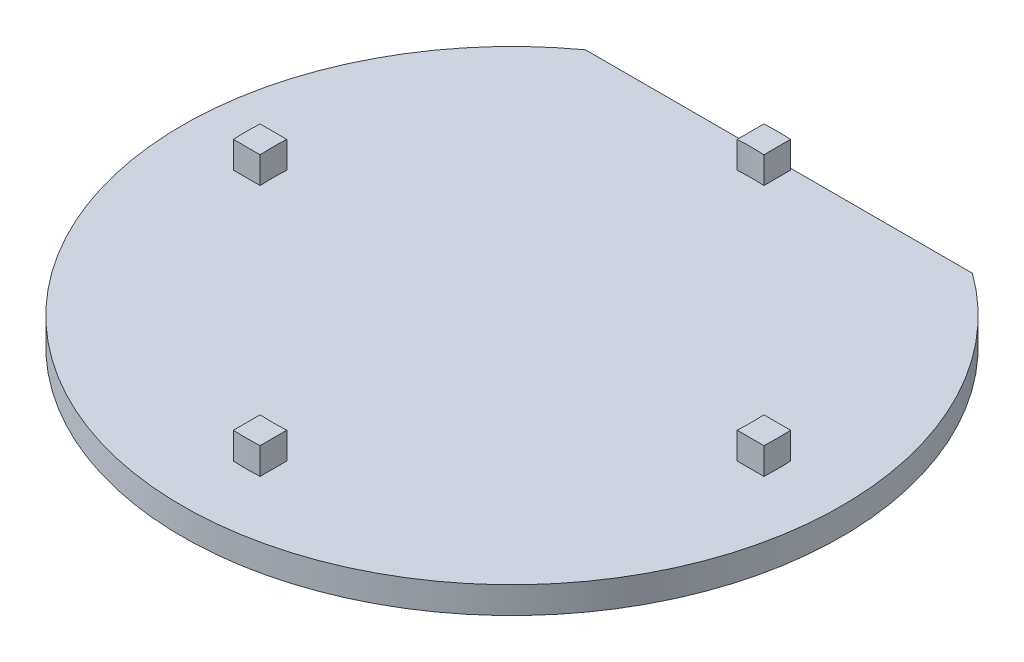
ISO-10303-21;
HEADER;
FILE_DESCRIPTION(('STEP AP214'),'2;1');
FILE_NAME('part.step','',(''),(''),'','','');
FILE_SCHEMA(('AUTOMOTIVE_DESIGN { 1 0 10303 214 1 1 1 1 }'));
ENDSEC;
DATA;
#1=APPLICATION_CONTEXT('core data for automotive mechanical design processes');
#2=APPLICATION_PROTOCOL_DEFINITION('international standard','automotive_design',2000,#1);
#3=PRODUCT_CONTEXT('',#1,'mechanical');
#4=PRODUCT('Part','Part','',(#3));
#5=PRODUCT_RELATED_PRODUCT_CATEGORY('part','',(#4));
#6=PRODUCT_DEFINITION_FORMATION('','',#4);
#7=PRODUCT_DEFINITION_CONTEXT('part definition',#1,'design');
#8=PRODUCT_DEFINITION('design','',#6,#7);
#9=PRODUCT_DEFINITION_SHAPE('','',#8);
#10=(LENGTH_UNIT() NAMED_UNIT(*) SI_UNIT(.MILLI.,.METRE.));
#11=(NAMED_UNIT(*) PLANE_ANGLE_UNIT() SI_UNIT($,.RADIAN.));
#12=(NAMED_UNIT(*) SI_UNIT($,.STERADIAN.) SOLID_ANGLE_UNIT());
#13=UNCERTAINTY_MEASURE_WITH_UNIT(LENGTH_MEASURE(1.E-05),#10,'distance_accuracy_value','');
#14=(GEOMETRIC_REPRESENTATION_CONTEXT(3) GLOBAL_UNCERTAINTY_ASSIGNED_CONTEXT((#13)) GLOBAL_UNIT_ASSIGNED_CONTEXT((#10,
#11,#12)) REPRESENTATION_CONTEXT('',''));
#15=CARTESIAN_POINT('',(0.,0.,0.));
#16=DIRECTION('',(0.,0.,1.));
#17=DIRECTION('',(1.,0.,0.));
#18=AXIS2_PLACEMENT_3D('',#15,#16,#17);
#19=CARTESIAN_POINT('',(0.,2.,0.));
#20=DIRECTION('',(0.,1.,0.));
#21=DIRECTION('',(0.,0.,1.));
#22=AXIS2_PLACEMENT_3D('',#19,#20,#21);
#23=PLANE('',#22);
#24=DIRECTION('',(1.,0.,0.));
#25=VECTOR('',#24,1.);
#26=CARTESIAN_POINT('',(17.8720452103278,2.,1.00000000000012));
#27=LINE('',#26,#25);
#28=CARTESIAN_POINT('',(17.8720452103278,2.,1.00000000000012));
#29=VERTEX_POINT('',#28);
#30=CARTESIAN_POINT('',(19.8748584900622,2.,1.00000000000014));
#31=VERTEX_POINT('',#30);
#32=EDGE_CURVE('E191',#29,#31,#27,.T.);
#33=ORIENTED_EDGE('',*,*,#32,.F.);
#34=CARTESIAN_POINT('',(0.,2.,0.));
#35=DIRECTION('',(0.,-1.,0.));
#36=DIRECTION('',(0.,0.,1.));
#37=AXIS2_PLACEMENT_3D('',#34,#35,#36);
#38=CIRCLE('',#37,17.9);
#39=CARTESIAN_POINT('',(17.8720452103278,2.,-0.999999999999875));
#40=VERTEX_POINT('',#39);
#41=EDGE_CURVE('E188',#40,#29,#38,.T.);
#42=ORIENTED_EDGE('',*,*,#41,.F.);
#43=DIRECTION('',(-1.,0.,0.));
#44=VECTOR('',#43,1.);
#45=CARTESIAN_POINT('',(17.8720452103278,2.,-0.999999999999875));
#46=LINE('',#45,#44);
#47=CARTESIAN_POINT('',(19.8748584900623,2.,-0.99999999999986));
#48=VERTEX_POINT('',#47);
#49=EDGE_CURVE('E200',#48,#40,#46,.T.);
#50=ORIENTED_EDGE('',*,*,#49,.F.);
#51=CARTESIAN_POINT('',(0.,2.,0.));
#52=DIRECTION('',(0.,1.,0.));
#53=DIRECTION('',(0.,0.,1.));
#54=AXIS2_PLACEMENT_3D('',#51,#52,#53);
#55=CIRCLE('',#54,19.9);
#56=EDGE_CURVE('E208',#31,#48,#55,.T.);
#57=ORIENTED_EDGE('',*,*,#56,.F.);
#58=EDGE_LOOP('',(#33,#42,#50,#57));
#59=FACE_BOUND('',#58,.T.);
#60=DIRECTION('',(-1.,0.,0.));
#61=VECTOR('',#60,1.);
#62=CARTESIAN_POINT('',(-17.8720452103278,2.,-1.));
#63=LINE('',#62,#61);
#64=CARTESIAN_POINT('',(-17.8720452103278,2.,-1.));
#65=VERTEX_POINT('',#64);
#66=CARTESIAN_POINT('',(-19.8748584900623,2.,-0.999999999999999));
#67=VERTEX_POINT('',#66);
#68=EDGE_CURVE('E262',#65,#67,#63,.T.);
#69=ORIENTED_EDGE('',*,*,#68,.F.);
#70=CARTESIAN_POINT('',(0.,2.,0.));
#71=DIRECTION('',(0.,-1.,0.));
#72=DIRECTION('',(0.,0.,1.));
#73=AXIS2_PLACEMENT_3D('',#70,#71,#72);
#74=CIRCLE('',#73,17.9);
#75=CARTESIAN_POINT('',(-17.8720452103278,2.,1.));
#76=VERTEX_POINT('',#75);
#77=EDGE_CURVE('E248',#76,#65,#74,.T.);
#78=ORIENTED_EDGE('',*,*,#77,.F.);
#79=DIRECTION('',(1.,0.,0.));
#80=VECTOR('',#79,1.);
#81=CARTESIAN_POINT('',(-17.8720452103278,2.,1.));
#82=LINE('',#81,#80);
#83=CARTESIAN_POINT('',(-19.8748584900623,2.,0.999999999999999));
#84=VERTEX_POINT('',#83);
#85=EDGE_CURVE('E253',#84,#76,#82,.T.);
#86=ORIENTED_EDGE('',*,*,#85,.F.);
#87=CARTESIAN_POINT('',(0.,2.,0.));
#88=DIRECTION('',(0.,1.,0.));
#89=DIRECTION('',(0.,0.,1.));
#90=AXIS2_PLACEMENT_3D('',#87,#88,#89);
#91=CIRCLE('',#90,19.9);
#92=EDGE_CURVE('E264',#67,#84,#91,.T.);
#93=ORIENTED_EDGE('',*,*,#92,.F.);
#94=EDGE_LOOP('',(#69,#78,#86,#93));
#95=FACE_BOUND('',#94,.T.);
#96=CARTESIAN_POINT('',(0.,2.,0.));
#97=DIRECTION('',(0.,1.,0.));
#98=DIRECTION('',(0.,0.,1.));
#99=AXIS2_PLACEMENT_3D('',#96,#97,#98);
#100=CIRCLE('',#99,24.7);
#101=CARTESIAN_POINT('',(-14.4944817085676,2.,-20.));
#102=VERTEX_POINT('',#101);
#103=CARTESIAN_POINT('',(14.4944817085676,2.,-20.));
#104=VERTEX_POINT('',#103);
#105=EDGE_CURVE('E278',#102,#104,#100,.T.);
#106=ORIENTED_EDGE('',*,*,#105,.T.);
#107=DIRECTION('',(-1.,0.,0.));
#108=VECTOR('',#107,1.);
#109=CARTESIAN_POINT('',(14.4944817085676,2.,-20.));
#110=LINE('',#109,#108);
#111=EDGE_CURVE('E281',#104,#102,#110,.T.);
#112=ORIENTED_EDGE('',*,*,#111,.T.);
#113=EDGE_LOOP('',(#106,#112));
#114=FACE_BOUND('',#113,.T.);
#115=DIRECTION('',(0.,0.,-1.));
#116=VECTOR('',#115,1.);
#117=CARTESIAN_POINT('',(1.00000000000006,2.,-17.8720452103278));
#118=LINE('',#117,#116);
#119=CARTESIAN_POINT('',(1.00000000000006,2.,-17.8720452103278));
#120=VERTEX_POINT('',#119);
#121=CARTESIAN_POINT('',(1.00000000000007,2.,-19.8748584900623));
#122=VERTEX_POINT('',#121);
#123=EDGE_CURVE('E233',#120,#122,#118,.T.);
#124=ORIENTED_EDGE('',*,*,#123,.F.);
#125=CARTESIAN_POINT('',(0.,2.,0.));
#126=DIRECTION('',(0.,-1.,0.));
#127=DIRECTION('',(0.,0.,1.));
#128=AXIS2_PLACEMENT_3D('',#125,#126,#127);
#129=CIRCLE('',#128,17.9);
#130=CARTESIAN_POINT('',(-0.999999999999937,2.,-17.8720452103278));
#131=VERTEX_POINT('',#130);
#132=EDGE_CURVE('E219',#131,#120,#129,.T.);
#133=ORIENTED_EDGE('',*,*,#132,.F.);
#134=DIRECTION('',(0.,0.,1.));
#135=VECTOR('',#134,1.);
#136=CARTESIAN_POINT('',(-0.999999999999937,2.,-17.8720452103278));
#137=LINE('',#136,#135);
#138=CARTESIAN_POINT('',(-0.99999999999993,2.,-19.8748584900623));
#139=VERTEX_POINT('',#138);
#140=EDGE_CURVE('E224',#139,#131,#137,.T.);
#141=ORIENTED_EDGE('',*,*,#140,.F.);
#142=CARTESIAN_POINT('',(0.,2.,0.));
#143=DIRECTION('',(0.,1.,0.));
#144=DIRECTION('',(0.,0.,1.));
#145=AXIS2_PLACEMENT_3D('',#142,#143,#144);
#146=CIRCLE('',#145,19.9);
#147=EDGE_CURVE('E235',#122,#139,#146,.T.);
#148=ORIENTED_EDGE('',*,*,#147,.F.);
#149=EDGE_LOOP('',(#124,#133,#141,#148));
#150=FACE_BOUND('',#149,.T.);
#151=DIRECTION('',(0.,0.,1.));
#152=VECTOR('',#151,1.);
#153=CARTESIAN_POINT('',(-1.00000000000019,2.,17.8720452103278));
#154=LINE('',#153,#152);
#155=CARTESIAN_POINT('',(-1.00000000000019,2.,17.8720452103278));
#156=VERTEX_POINT('',#155);
#157=CARTESIAN_POINT('',(-1.00000000000021,2.,19.8748584900622));
#158=VERTEX_POINT('',#157);
#159=EDGE_CURVE('E306',#156,#158,#154,.T.);
#160=ORIENTED_EDGE('',*,*,#159,.F.);
#161=CARTESIAN_POINT('',(0.,2.,0.));
#162=DIRECTION('',(0.,-1.,0.));
#163=DIRECTION('',(0.,0.,1.));
#164=AXIS2_PLACEMENT_3D('',#161,#162,#163);
#165=CIRCLE('',#164,17.9);
#166=CARTESIAN_POINT('',(0.999999999999812,2.,17.8720452103278));
#167=VERTEX_POINT('',#166);
#168=EDGE_CURVE('E186',#167,#156,#165,.T.);
#169=ORIENTED_EDGE('',*,*,#168,.F.);
#170=DIRECTION('',(0.,0.,-1.));
#171=VECTOR('',#170,1.);
#172=CARTESIAN_POINT('',(0.999999999999812,2.,17.8720452103278));
#173=LINE('',#172,#171);
#174=CARTESIAN_POINT('',(0.999999999999791,2.,19.8748584900623));
#175=VERTEX_POINT('',#174);
#176=EDGE_CURVE('E182',#175,#167,#173,.T.);
#177=ORIENTED_EDGE('',*,*,#176,.F.);
#178=CARTESIAN_POINT('',(0.,2.,0.));
#179=DIRECTION('',(0.,1.,0.));
#180=DIRECTION('',(0.,0.,1.));
#181=AXIS2_PLACEMENT_3D('',#178,#179,#180);
#182=CIRCLE('',#181,19.9);
#183=EDGE_CURVE('E308',#158,#175,#182,.T.);
#184=ORIENTED_EDGE('',*,*,#183,.F.);
#185=EDGE_LOOP('',(#160,#169,#177,#184));
#186=FACE_BOUND('',#185,.T.);
#187=ADVANCED_FACE('F37',(#59,#95,#114,#150,#186),#23,.T.);
#188=CARTESIAN_POINT('',(0.,2.,0.));
#189=DIRECTION('',(0.,-1.,0.));
#190=DIRECTION('',(0.,0.,-1.));
#191=AXIS2_PLACEMENT_3D('',#188,#189,#190);
#192=CYLINDRICAL_SURFACE('',#191,24.7);
#193=CARTESIAN_POINT('',(0.,0.,0.));
#194=DIRECTION('',(0.,1.,0.));
#195=DIRECTION('',(0.,0.,1.));
#196=AXIS2_PLACEMENT_3D('',#193,#194,#195);
#197=CIRCLE('',#196,24.7);
#198=CARTESIAN_POINT('',(-14.4944817085676,0.,-20.));
#199=VERTEX_POINT('',#198);
#200=CARTESIAN_POINT('',(14.4944817085676,0.,-20.));
#201=VERTEX_POINT('',#200);
#202=EDGE_CURVE('E277',#199,#201,#197,.T.);
#203=ORIENTED_EDGE('',*,*,#202,.T.);
#204=DIRECTION('',(0.,-1.,0.));
#205=VECTOR('',#204,1.);
#206=CARTESIAN_POINT('',(14.4944817085676,2.,-20.));
#207=LINE('',#206,#205);
#208=EDGE_CURVE('E11',#104,#201,#207,.T.);
#209=ORIENTED_EDGE('',*,*,#208,.F.);
#210=ORIENTED_EDGE('',*,*,#105,.F.);
#211=DIRECTION('',(0.,-1.,0.));
#212=VECTOR('',#211,1.);
#213=CARTESIAN_POINT('',(-14.4944817085676,2.,-20.));
#214=LINE('',#213,#212);
#215=EDGE_CURVE('E45',#102,#199,#214,.T.);
#216=ORIENTED_EDGE('',*,*,#215,.T.);
#217=EDGE_LOOP('',(#203,#209,#210,#216));
#218=FACE_BOUND('',#217,.T.);
#219=ADVANCED_FACE('F39',(#218),#192,.T.);
#220=CARTESIAN_POINT('',(14.4944817085676,2.,-20.));
#221=DIRECTION('',(0.,0.,1.));
#222=DIRECTION('',(1.,0.,0.));
#223=AXIS2_PLACEMENT_3D('',#220,#221,#222);
#224=PLANE('',#223);
#225=DIRECTION('',(-1.,0.,0.));
#226=VECTOR('',#225,1.);
#227=CARTESIAN_POINT('',(14.4944817085676,0.,-20.));
#228=LINE('',#227,#226);
#229=EDGE_CURVE('E282',#201,#199,#228,.T.);
#230=ORIENTED_EDGE('',*,*,#229,.T.);
#231=ORIENTED_EDGE('',*,*,#215,.F.);
#232=ORIENTED_EDGE('',*,*,#111,.F.);
#233=ORIENTED_EDGE('',*,*,#208,.T.);
#234=EDGE_LOOP('',(#230,#231,#232,#233));
#235=FACE_BOUND('',#234,.T.);
#236=ADVANCED_FACE('F295',(#235),#224,.F.);
#237=CARTESIAN_POINT('',(0.,0.,0.));
#238=DIRECTION('',(0.,1.,0.));
#239=DIRECTION('',(0.,0.,1.));
#240=AXIS2_PLACEMENT_3D('',#237,#238,#239);
#241=PLANE('',#240);
#242=ORIENTED_EDGE('',*,*,#202,.F.);
#243=ORIENTED_EDGE('',*,*,#229,.F.);
#244=EDGE_LOOP('',(#242,#243));
#245=FACE_BOUND('',#244,.T.);
#246=ADVANCED_FACE('F294',(#245),#241,.F.);
#247=CARTESIAN_POINT('',(0.,4.,0.));
#248=DIRECTION('',(0.,-1.,0.));
#249=DIRECTION('',(0.,0.,-1.));
#250=AXIS2_PLACEMENT_3D('',#247,#248,#249);
#251=CYLINDRICAL_SURFACE('',#250,17.9);
#252=ORIENTED_EDGE('',*,*,#77,.T.);
#253=DIRECTION('',(0.,-1.,0.));
#254=VECTOR('',#253,1.);
#255=CARTESIAN_POINT('',(-17.8720452103278,4.,-1.));
#256=LINE('',#255,#254);
#257=CARTESIAN_POINT('',(-17.8720452103278,4.,-1.));
#258=VERTEX_POINT('',#257);
#259=EDGE_CURVE('E275',#258,#65,#256,.T.);
#260=ORIENTED_EDGE('',*,*,#259,.F.);
#261=CARTESIAN_POINT('',(0.,4.,0.));
#262=DIRECTION('',(0.,-1.,0.));
#263=DIRECTION('',(0.,0.,1.));
#264=AXIS2_PLACEMENT_3D('',#261,#262,#263);
#265=CIRCLE('',#264,17.9);
#266=CARTESIAN_POINT('',(-17.8720452103278,4.,1.));
#267=VERTEX_POINT('',#266);
#268=EDGE_CURVE('E249',#267,#258,#265,.T.);
#269=ORIENTED_EDGE('',*,*,#268,.F.);
#270=DIRECTION('',(0.,-1.,0.));
#271=VECTOR('',#270,1.);
#272=CARTESIAN_POINT('',(-17.8720452103278,4.,1.));
#273=LINE('',#272,#271);
#274=EDGE_CURVE('E259',#267,#76,#273,.T.);
#275=ORIENTED_EDGE('',*,*,#274,.T.);
#276=EDGE_LOOP('',(#252,#260,#269,#275));
#277=FACE_BOUND('',#276,.T.);
#278=ADVANCED_FACE('F387',(#277),#251,.F.);
#279=CARTESIAN_POINT('',(-17.8720452103278,4.,-1.));
#280=DIRECTION('',(0.,0.,1.));
#281=DIRECTION('',(1.,0.,0.));
#282=AXIS2_PLACEMENT_3D('',#279,#280,#281);
#283=PLANE('',#282);
#284=ORIENTED_EDGE('',*,*,#68,.T.);
#285=DIRECTION('',(0.,-1.,0.));
#286=VECTOR('',#285,1.);
#287=CARTESIAN_POINT('',(-19.8748584900623,4.,-0.999999999999999));
#288=LINE('',#287,#286);
#289=CARTESIAN_POINT('',(-19.8748584900623,4.,-0.999999999999999));
#290=VERTEX_POINT('',#289);
#291=EDGE_CURVE('E272',#290,#67,#288,.T.);
#292=ORIENTED_EDGE('',*,*,#291,.F.);
#293=DIRECTION('',(-1.,0.,0.));
#294=VECTOR('',#293,1.);
#295=CARTESIAN_POINT('',(-17.8720452103278,4.,-1.));
#296=LINE('',#295,#294);
#297=EDGE_CURVE('E252',#258,#290,#296,.T.);
#298=ORIENTED_EDGE('',*,*,#297,.F.);
#299=ORIENTED_EDGE('',*,*,#259,.T.);
#300=EDGE_LOOP('',(#284,#292,#298,#299));
#301=FACE_BOUND('',#300,.T.);
#302=ADVANCED_FACE('F383',(#301),#283,.F.);
#303=CARTESIAN_POINT('',(0.,4.,0.));
#304=DIRECTION('',(0.,-1.,0.));
#305=DIRECTION('',(0.,0.,-1.));
#306=AXIS2_PLACEMENT_3D('',#303,#304,#305);
#307=CYLINDRICAL_SURFACE('',#306,19.9);
#308=ORIENTED_EDGE('',*,*,#92,.T.);
#309=DIRECTION('',(0.,-1.,0.));
#310=VECTOR('',#309,1.);
#311=CARTESIAN_POINT('',(-19.8748584900623,4.,0.999999999999997));
#312=LINE('',#311,#310);
#313=CARTESIAN_POINT('',(-19.8748584900623,4.,0.999999999999997));
#314=VERTEX_POINT('',#313);
#315=EDGE_CURVE('E270',#314,#84,#312,.T.);
#316=ORIENTED_EDGE('',*,*,#315,.F.);
#317=CARTESIAN_POINT('',(0.,4.,0.));
#318=DIRECTION('',(0.,1.,0.));
#319=DIRECTION('',(0.,0.,1.));
#320=AXIS2_PLACEMENT_3D('',#317,#318,#319);
#321=CIRCLE('',#320,19.9);
#322=EDGE_CURVE('E255',#290,#314,#321,.T.);
#323=ORIENTED_EDGE('',*,*,#322,.F.);
#324=ORIENTED_EDGE('',*,*,#291,.T.);
#325=EDGE_LOOP('',(#308,#316,#323,#324));
#326=FACE_BOUND('',#325,.T.);
#327=ADVANCED_FACE('F379',(#326),#307,.T.);
#328=CARTESIAN_POINT('',(-17.8720452103278,4.,1.));
#329=DIRECTION('',(0.,0.,-1.));
#330=DIRECTION('',(-1.,0.,0.));
#331=AXIS2_PLACEMENT_3D('',#328,#329,#330);
#332=PLANE('',#331);
#333=ORIENTED_EDGE('',*,*,#85,.T.);
#334=ORIENTED_EDGE('',*,*,#274,.F.);
#335=DIRECTION('',(1.,0.,0.));
#336=VECTOR('',#335,1.);
#337=CARTESIAN_POINT('',(-17.8720452103278,4.,1.));
#338=LINE('',#337,#336);
#339=EDGE_CURVE('E257',#314,#267,#338,.T.);
#340=ORIENTED_EDGE('',*,*,#339,.F.);
#341=ORIENTED_EDGE('',*,*,#315,.T.);
#342=EDGE_LOOP('',(#333,#334,#340,#341));
#343=FACE_BOUND('',#342,.T.);
#344=ADVANCED_FACE('F375',(#343),#332,.F.);
#345=CARTESIAN_POINT('',(0.,4.,0.));
#346=DIRECTION('',(0.,1.,0.));
#347=DIRECTION('',(0.,0.,1.));
#348=AXIS2_PLACEMENT_3D('',#345,#346,#347);
#349=PLANE('',#348);
#350=ORIENTED_EDGE('',*,*,#268,.T.);
#351=ORIENTED_EDGE('',*,*,#297,.T.);
#352=ORIENTED_EDGE('',*,*,#322,.T.);
#353=ORIENTED_EDGE('',*,*,#339,.T.);
#354=EDGE_LOOP('',(#350,#351,#352,#353));
#355=FACE_BOUND('',#354,.T.);
#356=ADVANCED_FACE('F371',(#355),#349,.T.);
#357=CARTESIAN_POINT('',(0.,4.,0.));
#358=DIRECTION('',(0.,-1.,0.));
#359=DIRECTION('',(0.,0.,-1.));
#360=AXIS2_PLACEMENT_3D('',#357,#358,#359);
#361=CYLINDRICAL_SURFACE('',#360,17.9);
#362=ORIENTED_EDGE('',*,*,#132,.T.);
#363=DIRECTION('',(0.,-1.,0.));
#364=VECTOR('',#363,1.);
#365=CARTESIAN_POINT('',(1.00000000000006,4.,-17.8720452103278));
#366=LINE('',#365,#364);
#367=CARTESIAN_POINT('',(1.00000000000006,4.,-17.8720452103278));
#368=VERTEX_POINT('',#367);
#369=EDGE_CURVE('E246',#368,#120,#366,.T.);
#370=ORIENTED_EDGE('',*,*,#369,.F.);
#371=CARTESIAN_POINT('',(0.,4.,0.));
#372=DIRECTION('',(0.,-1.,0.));
#373=DIRECTION('',(0.,0.,1.));
#374=AXIS2_PLACEMENT_3D('',#371,#372,#373);
#375=CIRCLE('',#374,17.9);
#376=CARTESIAN_POINT('',(-0.999999999999937,4.,-17.8720452103278));
#377=VERTEX_POINT('',#376);
#378=EDGE_CURVE('E220',#377,#368,#375,.T.);
#379=ORIENTED_EDGE('',*,*,#378,.F.);
#380=DIRECTION('',(0.,-1.,0.));
#381=VECTOR('',#380,1.);
#382=CARTESIAN_POINT('',(-0.999999999999937,4.,-17.8720452103278));
#383=LINE('',#382,#381);
#384=EDGE_CURVE('E230',#377,#131,#383,.T.);
#385=ORIENTED_EDGE('',*,*,#384,.T.);
#386=EDGE_LOOP('',(#362,#370,#379,#385));
#387=FACE_BOUND('',#386,.T.);
#388=ADVANCED_FACE('F367',(#387),#361,.F.);
#389=CARTESIAN_POINT('',(1.00000000000006,4.,-17.8720452103278));
#390=DIRECTION('',(-1.,0.,0.));
#391=DIRECTION('',(0.,0.,1.));
#392=AXIS2_PLACEMENT_3D('',#389,#390,#391);
#393=PLANE('',#392);
#394=ORIENTED_EDGE('',*,*,#123,.T.);
#395=DIRECTION('',(0.,-1.,0.));
#396=VECTOR('',#395,1.);
#397=CARTESIAN_POINT('',(1.00000000000007,4.,-19.8748584900623));
#398=LINE('',#397,#396);
#399=CARTESIAN_POINT('',(1.00000000000007,4.,-19.8748584900623));
#400=VERTEX_POINT('',#399);
#401=EDGE_CURVE('E243',#400,#122,#398,.T.);
#402=ORIENTED_EDGE('',*,*,#401,.F.);
#403=DIRECTION('',(0.,0.,-1.));
#404=VECTOR('',#403,1.);
#405=CARTESIAN_POINT('',(1.00000000000006,4.,-17.8720452103278));
#406=LINE('',#405,#404);
#407=EDGE_CURVE('E223',#368,#400,#406,.T.);
#408=ORIENTED_EDGE('',*,*,#407,.F.);
#409=ORIENTED_EDGE('',*,*,#369,.T.);
#410=EDGE_LOOP('',(#394,#402,#408,#409));
#411=FACE_BOUND('',#410,.T.);
#412=ADVANCED_FACE('F363',(#411),#393,.F.);
#413=CARTESIAN_POINT('',(0.,4.,0.));
#414=DIRECTION('',(0.,-1.,0.));
#415=DIRECTION('',(0.,0.,-1.));
#416=AXIS2_PLACEMENT_3D('',#413,#414,#415);
#417=CYLINDRICAL_SURFACE('',#416,19.9);
#418=ORIENTED_EDGE('',*,*,#147,.T.);
#419=DIRECTION('',(0.,-1.,0.));
#420=VECTOR('',#419,1.);
#421=CARTESIAN_POINT('',(-0.999999999999928,4.,-19.8748584900623));
#422=LINE('',#421,#420);
#423=CARTESIAN_POINT('',(-0.999999999999928,4.,-19.8748584900623));
#424=VERTEX_POINT('',#423);
#425=EDGE_CURVE('E241',#424,#139,#422,.T.);
#426=ORIENTED_EDGE('',*,*,#425,.F.);
#427=CARTESIAN_POINT('',(0.,4.,0.));
#428=DIRECTION('',(0.,1.,0.));
#429=DIRECTION('',(0.,0.,1.));
#430=AXIS2_PLACEMENT_3D('',#427,#428,#429);
#431=CIRCLE('',#430,19.9);
#432=EDGE_CURVE('E226',#400,#424,#431,.T.);
#433=ORIENTED_EDGE('',*,*,#432,.F.);
#434=ORIENTED_EDGE('',*,*,#401,.T.);
#435=EDGE_LOOP('',(#418,#426,#433,#434));
#436=FACE_BOUND('',#435,.T.);
#437=ADVANCED_FACE('F359',(#436),#417,.T.);
#438=CARTESIAN_POINT('',(-0.999999999999937,4.,-17.8720452103278));
#439=DIRECTION('',(1.,0.,0.));
#440=DIRECTION('',(0.,0.,-1.));
#441=AXIS2_PLACEMENT_3D('',#438,#439,#440);
#442=PLANE('',#441);
#443=ORIENTED_EDGE('',*,*,#140,.T.);
#444=ORIENTED_EDGE('',*,*,#384,.F.);
#445=DIRECTION('',(0.,0.,1.));
#446=VECTOR('',#445,1.);
#447=CARTESIAN_POINT('',(-0.999999999999937,4.,-17.8720452103278));
#448=LINE('',#447,#446);
#449=EDGE_CURVE('E228',#424,#377,#448,.T.);
#450=ORIENTED_EDGE('',*,*,#449,.F.);
#451=ORIENTED_EDGE('',*,*,#425,.T.);
#452=EDGE_LOOP('',(#443,#444,#450,#451));
#453=FACE_BOUND('',#452,.T.);
#454=ADVANCED_FACE('F355',(#453),#442,.F.);
#455=CARTESIAN_POINT('',(0.,4.,0.));
#456=DIRECTION('',(0.,1.,0.));
#457=DIRECTION('',(0.,0.,1.));
#458=AXIS2_PLACEMENT_3D('',#455,#456,#457);
#459=PLANE('',#458);
#460=ORIENTED_EDGE('',*,*,#378,.T.);
#461=ORIENTED_EDGE('',*,*,#407,.T.);
#462=ORIENTED_EDGE('',*,*,#432,.T.);
#463=ORIENTED_EDGE('',*,*,#449,.T.);
#464=EDGE_LOOP('',(#460,#461,#462,#463));
#465=FACE_BOUND('',#464,.T.);
#466=ADVANCED_FACE('F351',(#465),#459,.T.);
#467=CARTESIAN_POINT('',(0.,4.,0.));
#468=DIRECTION('',(0.,-1.,0.));
#469=DIRECTION('',(0.,0.,-1.));
#470=AXIS2_PLACEMENT_3D('',#467,#468,#469);
#471=CYLINDRICAL_SURFACE('',#470,17.9);
#472=ORIENTED_EDGE('',*,*,#41,.T.);
#473=DIRECTION('',(0.,-1.,0.));
#474=VECTOR('',#473,1.);
#475=CARTESIAN_POINT('',(17.8720452103278,4.,1.00000000000012));
#476=LINE('',#475,#474);
#477=CARTESIAN_POINT('',(17.8720452103278,4.,1.00000000000012));
#478=VERTEX_POINT('',#477);
#479=EDGE_CURVE('E217',#478,#29,#476,.T.);
#480=ORIENTED_EDGE('',*,*,#479,.F.);
#481=CARTESIAN_POINT('',(0.,4.,0.));
#482=DIRECTION('',(0.,-1.,0.));
#483=DIRECTION('',(0.,0.,1.));
#484=AXIS2_PLACEMENT_3D('',#481,#482,#483);
#485=CIRCLE('',#484,17.9);
#486=CARTESIAN_POINT('',(17.8720452103278,4.,-0.999999999999875));
#487=VERTEX_POINT('',#486);
#488=EDGE_CURVE('E196',#487,#478,#485,.T.);
#489=ORIENTED_EDGE('',*,*,#488,.F.);
#490=DIRECTION('',(0.,-1.,0.));
#491=VECTOR('',#490,1.);
#492=CARTESIAN_POINT('',(17.8720452103278,4.,-0.999999999999875));
#493=LINE('',#492,#491);
#494=EDGE_CURVE('E205',#487,#40,#493,.T.);
#495=ORIENTED_EDGE('',*,*,#494,.T.);
#496=EDGE_LOOP('',(#472,#480,#489,#495));
#497=FACE_BOUND('',#496,.T.);
#498=ADVANCED_FACE('F347',(#497),#471,.F.);
#499=CARTESIAN_POINT('',(17.8720452103278,4.,1.00000000000012));
#500=DIRECTION('',(0.,0.,-1.));
#501=DIRECTION('',(-1.,0.,0.));
#502=AXIS2_PLACEMENT_3D('',#499,#500,#501);
#503=PLANE('',#502);
#504=ORIENTED_EDGE('',*,*,#32,.T.);
#505=DIRECTION('',(0.,-1.,0.));
#506=VECTOR('',#505,1.);
#507=CARTESIAN_POINT('',(19.8748584900622,4.,1.00000000000014));
#508=LINE('',#507,#506);
#509=CARTESIAN_POINT('',(19.8748584900622,4.,1.00000000000014));
#510=VERTEX_POINT('',#509);
#511=EDGE_CURVE('E214',#510,#31,#508,.T.);
#512=ORIENTED_EDGE('',*,*,#511,.F.);
#513=DIRECTION('',(1.,0.,0.));
#514=VECTOR('',#513,1.);
#515=CARTESIAN_POINT('',(17.8720452103278,4.,1.00000000000012));
#516=LINE('',#515,#514);
#517=EDGE_CURVE('E199',#478,#510,#516,.T.);
#518=ORIENTED_EDGE('',*,*,#517,.F.);
#519=ORIENTED_EDGE('',*,*,#479,.T.);
#520=EDGE_LOOP('',(#504,#512,#518,#519));
#521=FACE_BOUND('',#520,.T.);
#522=ADVANCED_FACE('F343',(#521),#503,.F.);
#523=CARTESIAN_POINT('',(0.,4.,0.));
#524=DIRECTION('',(0.,-1.,0.));
#525=DIRECTION('',(0.,0.,-1.));
#526=AXIS2_PLACEMENT_3D('',#523,#524,#525);
#527=CYLINDRICAL_SURFACE('',#526,19.9);
#528=ORIENTED_EDGE('',*,*,#56,.T.);
#529=DIRECTION('',(0.,-1.,0.));
#530=VECTOR('',#529,1.);
#531=CARTESIAN_POINT('',(19.8748584900623,4.,-0.999999999999858));
#532=LINE('',#531,#530);
#533=CARTESIAN_POINT('',(19.8748584900623,4.,-0.999999999999858));
#534=VERTEX_POINT('',#533);
#535=EDGE_CURVE('E60',#534,#48,#532,.T.);
#536=ORIENTED_EDGE('',*,*,#535,.F.);
#537=CARTESIAN_POINT('',(0.,4.,0.));
#538=DIRECTION('',(0.,1.,0.));
#539=DIRECTION('',(0.,0.,1.));
#540=AXIS2_PLACEMENT_3D('',#537,#538,#539);
#541=CIRCLE('',#540,19.9);
#542=EDGE_CURVE('E202',#510,#534,#541,.T.);
#543=ORIENTED_EDGE('',*,*,#542,.F.);
#544=ORIENTED_EDGE('',*,*,#511,.T.);
#545=EDGE_LOOP('',(#528,#536,#543,#544));
#546=FACE_BOUND('',#545,.T.);
#547=ADVANCED_FACE('F340',(#546),#527,.T.);
#548=CARTESIAN_POINT('',(17.8720452103278,4.,-0.999999999999875));
#549=DIRECTION('',(0.,0.,1.));
#550=DIRECTION('',(1.,0.,0.));
#551=AXIS2_PLACEMENT_3D('',#548,#549,#550);
#552=PLANE('',#551);
#553=ORIENTED_EDGE('',*,*,#49,.T.);
#554=ORIENTED_EDGE('',*,*,#494,.F.);
#555=DIRECTION('',(-1.,0.,0.));
#556=VECTOR('',#555,1.);
#557=CARTESIAN_POINT('',(17.8720452103278,4.,-0.999999999999875));
#558=LINE('',#557,#556);
#559=EDGE_CURVE('E204',#534,#487,#558,.T.);
#560=ORIENTED_EDGE('',*,*,#559,.F.);
#561=ORIENTED_EDGE('',*,*,#535,.T.);
#562=EDGE_LOOP('',(#553,#554,#560,#561));
#563=FACE_BOUND('',#562,.T.);
#564=ADVANCED_FACE('F336',(#563),#552,.F.);
#565=CARTESIAN_POINT('',(0.,4.,0.));
#566=DIRECTION('',(0.,1.,0.));
#567=DIRECTION('',(0.,0.,1.));
#568=AXIS2_PLACEMENT_3D('',#565,#566,#567);
#569=PLANE('',#568);
#570=ORIENTED_EDGE('',*,*,#488,.T.);
#571=ORIENTED_EDGE('',*,*,#517,.T.);
#572=ORIENTED_EDGE('',*,*,#542,.T.);
#573=ORIENTED_EDGE('',*,*,#559,.T.);
#574=EDGE_LOOP('',(#570,#571,#572,#573));
#575=FACE_BOUND('',#574,.T.);
#576=ADVANCED_FACE('F333',(#575),#569,.T.);
#577=CARTESIAN_POINT('',(0.,4.,0.));
#578=DIRECTION('',(0.,-1.,0.));
#579=DIRECTION('',(0.,0.,-1.));
#580=AXIS2_PLACEMENT_3D('',#577,#578,#579);
#581=CYLINDRICAL_SURFACE('',#580,17.9);
#582=ORIENTED_EDGE('',*,*,#168,.T.);
#583=DIRECTION('',(0.,-1.,0.));
#584=VECTOR('',#583,1.);
#585=CARTESIAN_POINT('',(-1.00000000000019,4.,17.8720452103278));
#586=LINE('',#585,#584);
#587=CARTESIAN_POINT('',(-1.00000000000019,4.,17.8720452103278));
#588=VERTEX_POINT('',#587);
#589=EDGE_CURVE('E167',#588,#156,#586,.T.);
#590=ORIENTED_EDGE('',*,*,#589,.F.);
#591=CARTESIAN_POINT('',(0.,4.,0.));
#592=DIRECTION('',(0.,-1.,0.));
#593=DIRECTION('',(0.,0.,1.));
#594=AXIS2_PLACEMENT_3D('',#591,#592,#593);
#595=CIRCLE('',#594,17.9);
#596=CARTESIAN_POINT('',(0.999999999999812,4.,17.8720452103278));
#597=VERTEX_POINT('',#596);
#598=EDGE_CURVE('E174',#597,#588,#595,.T.);
#599=ORIENTED_EDGE('',*,*,#598,.F.);
#600=DIRECTION('',(0.,-1.,0.));
#601=VECTOR('',#600,1.);
#602=CARTESIAN_POINT('',(0.999999999999812,4.,17.8720452103278));
#603=LINE('',#602,#601);
#604=EDGE_CURVE('E315',#597,#167,#603,.T.);
#605=ORIENTED_EDGE('',*,*,#604,.T.);
#606=EDGE_LOOP('',(#582,#590,#599,#605));
#607=FACE_BOUND('',#606,.T.);
#608=ADVANCED_FACE('F184',(#607),#581,.F.);
#609=CARTESIAN_POINT('',(-1.00000000000019,4.,17.8720452103278));
#610=DIRECTION('',(1.,0.,0.));
#611=DIRECTION('',(0.,0.,-1.));
#612=AXIS2_PLACEMENT_3D('',#609,#610,#611);
#613=PLANE('',#612);
#614=ORIENTED_EDGE('',*,*,#159,.T.);
#615=DIRECTION('',(0.,-1.,0.));
#616=VECTOR('',#615,1.);
#617=CARTESIAN_POINT('',(-1.00000000000021,4.,19.8748584900622));
#618=LINE('',#617,#616);
#619=CARTESIAN_POINT('',(-1.00000000000021,4.,19.8748584900622));
#620=VERTEX_POINT('',#619);
#621=EDGE_CURVE('E170',#620,#158,#618,.T.);
#622=ORIENTED_EDGE('',*,*,#621,.F.);
#623=DIRECTION('',(0.,0.,1.));
#624=VECTOR('',#623,1.);
#625=CARTESIAN_POINT('',(-1.00000000000019,4.,17.8720452103278));
#626=LINE('',#625,#624);
#627=EDGE_CURVE('E163',#588,#620,#626,.T.);
#628=ORIENTED_EDGE('',*,*,#627,.F.);
#629=ORIENTED_EDGE('',*,*,#589,.T.);
#630=EDGE_LOOP('',(#614,#622,#628,#629));
#631=FACE_BOUND('',#630,.T.);
#632=ADVANCED_FACE('F165',(#631),#613,.F.);
#633=CARTESIAN_POINT('',(0.,4.,0.));
#634=DIRECTION('',(0.,-1.,0.));
#635=DIRECTION('',(0.,0.,-1.));
#636=AXIS2_PLACEMENT_3D('',#633,#634,#635);
#637=CYLINDRICAL_SURFACE('',#636,19.9);
#638=ORIENTED_EDGE('',*,*,#183,.T.);
#639=DIRECTION('',(0.,-1.,0.));
#640=VECTOR('',#639,1.);
#641=CARTESIAN_POINT('',(0.999999999999789,4.,19.8748584900623));
#642=LINE('',#641,#640);
#643=CARTESIAN_POINT('',(0.999999999999789,4.,19.8748584900623));
#644=VERTEX_POINT('',#643);
#645=EDGE_CURVE('E52',#644,#175,#642,.T.);
#646=ORIENTED_EDGE('',*,*,#645,.F.);
#647=CARTESIAN_POINT('',(0.,4.,0.));
#648=DIRECTION('',(0.,1.,0.));
#649=DIRECTION('',(0.,0.,1.));
#650=AXIS2_PLACEMENT_3D('',#647,#648,#649);
#651=CIRCLE('',#650,19.9);
#652=EDGE_CURVE('E173',#620,#644,#651,.T.);
#653=ORIENTED_EDGE('',*,*,#652,.F.);
#654=ORIENTED_EDGE('',*,*,#621,.T.);
#655=EDGE_LOOP('',(#638,#646,#653,#654));
#656=FACE_BOUND('',#655,.T.);
#657=ADVANCED_FACE('F318',(#656),#637,.T.);
#658=CARTESIAN_POINT('',(0.999999999999812,4.,17.8720452103278));
#659=DIRECTION('',(-1.,0.,0.));
#660=DIRECTION('',(0.,0.,1.));
#661=AXIS2_PLACEMENT_3D('',#658,#659,#660);
#662=PLANE('',#661);
#663=ORIENTED_EDGE('',*,*,#176,.T.);
#664=ORIENTED_EDGE('',*,*,#604,.F.);
#665=DIRECTION('',(0.,0.,-1.));
#666=VECTOR('',#665,1.);
#667=CARTESIAN_POINT('',(0.999999999999812,4.,17.8720452103278));
#668=LINE('',#667,#666);
#669=EDGE_CURVE('E178',#644,#597,#668,.T.);
#670=ORIENTED_EDGE('',*,*,#669,.F.);
#671=ORIENTED_EDGE('',*,*,#645,.T.);
#672=EDGE_LOOP('',(#663,#664,#670,#671));
#673=FACE_BOUND('',#672,.T.);
#674=ADVANCED_FACE('F319',(#673),#662,.F.);
#675=CARTESIAN_POINT('',(0.,4.,0.));
#676=DIRECTION('',(0.,1.,0.));
#677=DIRECTION('',(0.,0.,1.));
#678=AXIS2_PLACEMENT_3D('',#675,#676,#677);
#679=PLANE('',#678);
#680=ORIENTED_EDGE('',*,*,#598,.T.);
#681=ORIENTED_EDGE('',*,*,#627,.T.);
#682=ORIENTED_EDGE('',*,*,#652,.T.);
#683=ORIENTED_EDGE('',*,*,#669,.T.);
#684=EDGE_LOOP('',(#680,#681,#682,#683));
#685=FACE_BOUND('',#684,.T.);
#686=ADVANCED_FACE('F177',(#685),#679,.T.);
#687=CLOSED_SHELL('',(#187,#219,#236,#246,#278,#302,#327,#344,#356,#388,#412,#437,#454,#466,
#498,#522,#547,#564,#576,#608,#632,#657,#674,#686));
#688=MANIFOLD_SOLID_BREP('B2',#687);
#689=ADVANCED_BREP_SHAPE_REPRESENTATION('',(#18,#688),#14);
#690=SHAPE_DEFINITION_REPRESENTATION(#9,#689);
ENDSEC;
END-ISO-10303-21;
